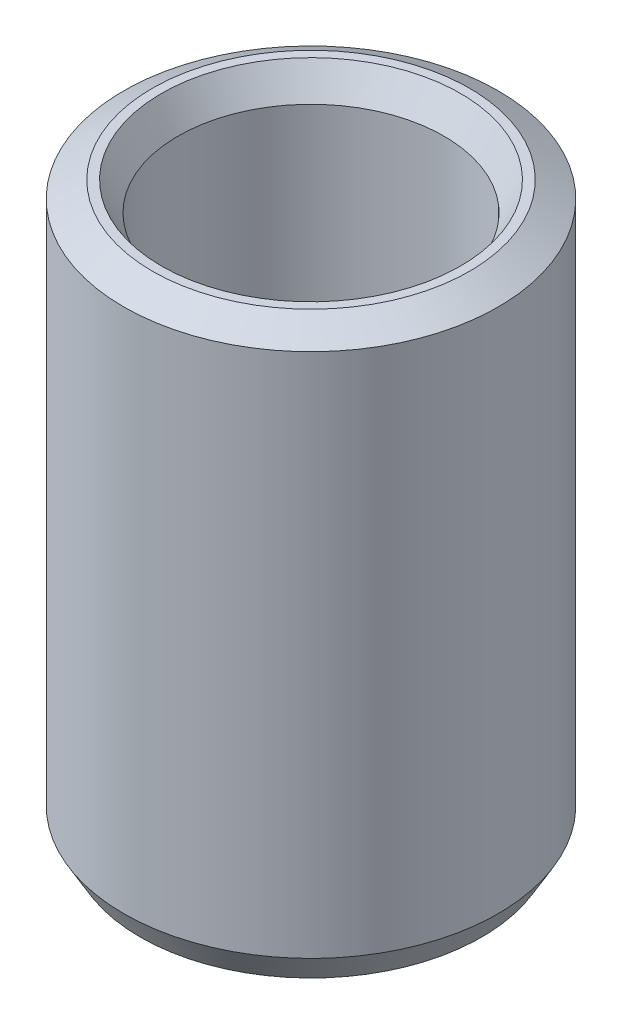
ISO-10303-21;
HEADER;
FILE_DESCRIPTION(('STEP AP214'),'2;1');
FILE_NAME('part.step','',(''),(''),'','','');
FILE_SCHEMA(('AUTOMOTIVE_DESIGN { 1 0 10303 214 1 1 1 1 }'));
ENDSEC;
DATA;
#1=APPLICATION_CONTEXT('core data for automotive mechanical design processes');
#2=APPLICATION_PROTOCOL_DEFINITION('international standard','automotive_design',2000,#1);
#3=PRODUCT_CONTEXT('',#1,'mechanical');
#4=PRODUCT('Part','Part','',(#3));
#5=PRODUCT_RELATED_PRODUCT_CATEGORY('part','',(#4));
#6=PRODUCT_DEFINITION_FORMATION('','',#4);
#7=PRODUCT_DEFINITION_CONTEXT('part definition',#1,'design');
#8=PRODUCT_DEFINITION('design','',#6,#7);
#9=PRODUCT_DEFINITION_SHAPE('','',#8);
#10=(LENGTH_UNIT() NAMED_UNIT(*) SI_UNIT(.MILLI.,.METRE.));
#11=(NAMED_UNIT(*) PLANE_ANGLE_UNIT() SI_UNIT($,.RADIAN.));
#12=(NAMED_UNIT(*) SI_UNIT($,.STERADIAN.) SOLID_ANGLE_UNIT());
#13=UNCERTAINTY_MEASURE_WITH_UNIT(LENGTH_MEASURE(1.E-05),#10,'distance_accuracy_value','');
#14=(GEOMETRIC_REPRESENTATION_CONTEXT(3) GLOBAL_UNCERTAINTY_ASSIGNED_CONTEXT((#13)) GLOBAL_UNIT_ASSIGNED_CONTEXT((#10,
#11,#12)) REPRESENTATION_CONTEXT('',''));
#15=CARTESIAN_POINT('',(0.,0.,0.));
#16=DIRECTION('',(0.,0.,1.));
#17=DIRECTION('',(1.,0.,0.));
#18=AXIS2_PLACEMENT_3D('',#15,#16,#17);
#19=CARTESIAN_POINT('',(0.,76.1938313444554,0.));
#20=DIRECTION('',(0.,-1.,0.));
#21=DIRECTION('',(0.,0.,-1.));
#22=AXIS2_PLACEMENT_3D('',#19,#20,#21);
#23=CYLINDRICAL_SURFACE('',#22,25.);
#24=CARTESIAN_POINT('',(0.,3.82731349677605,0.));
#25=DIRECTION('',(0.,1.,0.));
#26=DIRECTION('',(0.,0.,1.));
#27=AXIS2_PLACEMENT_3D('',#24,#25,#26);
#28=CIRCLE('',#27,25.);
#29=CARTESIAN_POINT('',(0.,3.82731349677605,25.));
#30=VERTEX_POINT('',#29);
#31=EDGE_CURVE('E10',#30,#30,#28,.T.);
#32=ORIENTED_EDGE('',*,*,#31,.T.);
#33=EDGE_LOOP('',(#32));
#34=FACE_BOUND('',#33,.T.);
#35=CARTESIAN_POINT('',(0.,73.9841308668187,0.));
#36=DIRECTION('',(0.,1.,0.));
#37=DIRECTION('',(0.,0.,1.));
#38=AXIS2_PLACEMENT_3D('',#35,#36,#37);
#39=CIRCLE('',#38,25.);
#40=CARTESIAN_POINT('',(0.,73.9841308668187,25.));
#41=VERTEX_POINT('',#40);
#42=EDGE_CURVE('E50',#41,#41,#39,.F.);
#43=ORIENTED_EDGE('',*,*,#42,.T.);
#44=EDGE_LOOP('',(#43));
#45=FACE_BOUND('',#44,.T.);
#46=ADVANCED_FACE('F39',(#34,#45),#23,.T.);
#47=CARTESIAN_POINT('',(0.,76.1938313444554,0.));
#48=DIRECTION('',(0.,1.,0.));
#49=DIRECTION('',(0.,0.,1.));
#50=AXIS2_PLACEMENT_3D('',#47,#48,#49);
#51=PLANE('',#50);
#52=CARTESIAN_POINT('',(0.,76.1938313444554,0.));
#53=DIRECTION('',(0.,1.,0.));
#54=DIRECTION('',(0.,0.,1.));
#55=AXIS2_PLACEMENT_3D('',#52,#53,#54);
#56=CIRCLE('',#55,19.9665679245581);
#57=CARTESIAN_POINT('',(0.,76.1938313444554,19.9665679245581));
#58=VERTEX_POINT('',#57);
#59=EDGE_CURVE('E58',#58,#58,#56,.F.);
#60=ORIENTED_EDGE('',*,*,#59,.T.);
#61=EDGE_LOOP('',(#60));
#62=FACE_BOUND('',#61,.T.);
#63=CARTESIAN_POINT('',(0.,76.1938313444554,0.));
#64=DIRECTION('',(0.,1.,0.));
#65=DIRECTION('',(0.,0.,1.));
#66=AXIS2_PLACEMENT_3D('',#63,#64,#65);
#67=CIRCLE('',#66,21.172686503224);
#68=CARTESIAN_POINT('',(0.,76.1938313444554,21.172686503224));
#69=VERTEX_POINT('',#68);
#70=EDGE_CURVE('E61',#69,#69,#67,.T.);
#71=ORIENTED_EDGE('',*,*,#70,.T.);
#72=EDGE_LOOP('',(#71));
#73=FACE_BOUND('',#72,.T.);
#74=ADVANCED_FACE('F88',(#62,#73),#51,.T.);
#75=CARTESIAN_POINT('',(0.,0.,0.));
#76=DIRECTION('',(0.,1.,0.));
#77=DIRECTION('',(0.,0.,1.));
#78=AXIS2_PLACEMENT_3D('',#75,#76,#77);
#79=PLANE('',#78);
#80=CARTESIAN_POINT('',(0.,0.,0.));
#81=DIRECTION('',(0.,1.,0.));
#82=DIRECTION('',(0.,0.,1.));
#83=AXIS2_PLACEMENT_3D('',#80,#81,#82);
#84=CIRCLE('',#83,21.5841809436973);
#85=CARTESIAN_POINT('',(0.,0.,21.5841809436973));
#86=VERTEX_POINT('',#85);
#87=EDGE_CURVE('E51',#86,#86,#84,.T.);
#88=ORIENTED_EDGE('',*,*,#87,.T.);
#89=EDGE_LOOP('',(#88));
#90=FACE_BOUND('',#89,.T.);
#91=CARTESIAN_POINT('',(0.,0.,0.));
#92=DIRECTION('',(0.,1.,0.));
#93=DIRECTION('',(0.,0.,1.));
#94=AXIS2_PLACEMENT_3D('',#91,#92,#93);
#95=CIRCLE('',#94,22.7902995223632);
#96=CARTESIAN_POINT('',(0.,0.,22.7902995223632));
#97=VERTEX_POINT('',#96);
#98=EDGE_CURVE('E54',#97,#97,#95,.F.);
#99=ORIENTED_EDGE('',*,*,#98,.T.);
#100=EDGE_LOOP('',(#99));
#101=FACE_BOUND('',#100,.T.);
#102=ADVANCED_FACE('F83',(#90,#101),#79,.F.);
#103=CARTESIAN_POINT('',(0.,76.1938313444554,0.));
#104=DIRECTION('',(0.,-1.,0.));
#105=DIRECTION('',(0.,0.,-1.));
#106=AXIS2_PLACEMENT_3D('',#103,#104,#105);
#107=CYLINDRICAL_SURFACE('',#106,17.7568674469213);
#108=CARTESIAN_POINT('',(0.,72.3665178476794,0.));
#109=DIRECTION('',(0.,1.,0.));
#110=DIRECTION('',(0.,0.,1.));
#111=AXIS2_PLACEMENT_3D('',#108,#109,#110);
#112=CIRCLE('',#111,17.7568674469213);
#113=CARTESIAN_POINT('',(0.,72.3665178476794,17.7568674469213));
#114=VERTEX_POINT('',#113);
#115=EDGE_CURVE('E67',#114,#114,#112,.T.);
#116=ORIENTED_EDGE('',*,*,#115,.T.);
#117=EDGE_LOOP('',(#116));
#118=FACE_BOUND('',#117,.T.);
#119=CARTESIAN_POINT('',(0.,2.20970047763673,0.));
#120=DIRECTION('',(0.,1.,0.));
#121=DIRECTION('',(0.,0.,1.));
#122=AXIS2_PLACEMENT_3D('',#119,#120,#121);
#123=CIRCLE('',#122,17.7568674469213);
#124=CARTESIAN_POINT('',(0.,2.20970047763673,17.7568674469213));
#125=VERTEX_POINT('',#124);
#126=EDGE_CURVE('E69',#125,#125,#123,.F.);
#127=ORIENTED_EDGE('',*,*,#126,.T.);
#128=EDGE_LOOP('',(#127));
#129=FACE_BOUND('',#128,.T.);
#130=ADVANCED_FACE('F71',(#118,#129),#107,.F.);
#131=CARTESIAN_POINT('',(0.,72.3665178476794,0.));
#132=DIRECTION('',(0.,1.,0.));
#133=DIRECTION('',(0.,0.,1.));
#134=AXIS2_PLACEMENT_3D('',#131,#132,#133);
#135=CONICAL_SURFACE('',#134,17.7568674469213,0.523598775598306);
#136=ORIENTED_EDGE('',*,*,#59,.F.);
#137=EDGE_LOOP('',(#136));
#138=FACE_BOUND('',#137,.T.);
#139=ORIENTED_EDGE('',*,*,#115,.F.);
#140=EDGE_LOOP('',(#139));
#141=FACE_BOUND('',#140,.T.);
#142=ADVANCED_FACE('F77',(#138,#141),#135,.F.);
#143=CARTESIAN_POINT('',(0.,0.,0.));
#144=DIRECTION('',(0.,-1.,0.));
#145=DIRECTION('',(0.,0.,-1.));
#146=AXIS2_PLACEMENT_3D('',#143,#144,#145);
#147=CONICAL_SURFACE('',#146,21.5841809436973,1.04719755119659);
#148=ORIENTED_EDGE('',*,*,#126,.F.);
#149=EDGE_LOOP('',(#148));
#150=FACE_BOUND('',#149,.T.);
#151=ORIENTED_EDGE('',*,*,#87,.F.);
#152=EDGE_LOOP('',(#151));
#153=FACE_BOUND('',#152,.T.);
#154=ADVANCED_FACE('F73',(#150,#153),#147,.F.);
#155=CARTESIAN_POINT('',(0.,3.82731349677605,0.));
#156=DIRECTION('',(0.,1.,0.));
#157=DIRECTION('',(0.,0.,1.));
#158=AXIS2_PLACEMENT_3D('',#155,#156,#157);
#159=CONICAL_SURFACE('',#158,25.,0.523598775598302);
#160=ORIENTED_EDGE('',*,*,#98,.F.);
#161=EDGE_LOOP('',(#160));
#162=FACE_BOUND('',#161,.T.);
#163=ORIENTED_EDGE('',*,*,#31,.F.);
#164=EDGE_LOOP('',(#163));
#165=FACE_BOUND('',#164,.T.);
#166=ADVANCED_FACE('F76',(#162,#165),#159,.T.);
#167=CARTESIAN_POINT('',(0.,76.1938313444554,0.));
#168=DIRECTION('',(0.,-1.,0.));
#169=DIRECTION('',(0.,0.,-1.));
#170=AXIS2_PLACEMENT_3D('',#167,#168,#169);
#171=CONICAL_SURFACE('',#170,21.172686503224,1.0471975511966);
#172=ORIENTED_EDGE('',*,*,#42,.F.);
#173=EDGE_LOOP('',(#172));
#174=FACE_BOUND('',#173,.T.);
#175=ORIENTED_EDGE('',*,*,#70,.F.);
#176=EDGE_LOOP('',(#175));
#177=FACE_BOUND('',#176,.T.);
#178=ADVANCED_FACE('F45',(#174,#177),#171,.T.);
#179=CLOSED_SHELL('',(#46,#74,#102,#130,#142,#154,#166,#178));
#180=MANIFOLD_SOLID_BREP('B2',#179);
#181=ADVANCED_BREP_SHAPE_REPRESENTATION('',(#18,#180),#14);
#182=SHAPE_DEFINITION_REPRESENTATION(#9,#181);
ENDSEC;
END-ISO-10303-21;
